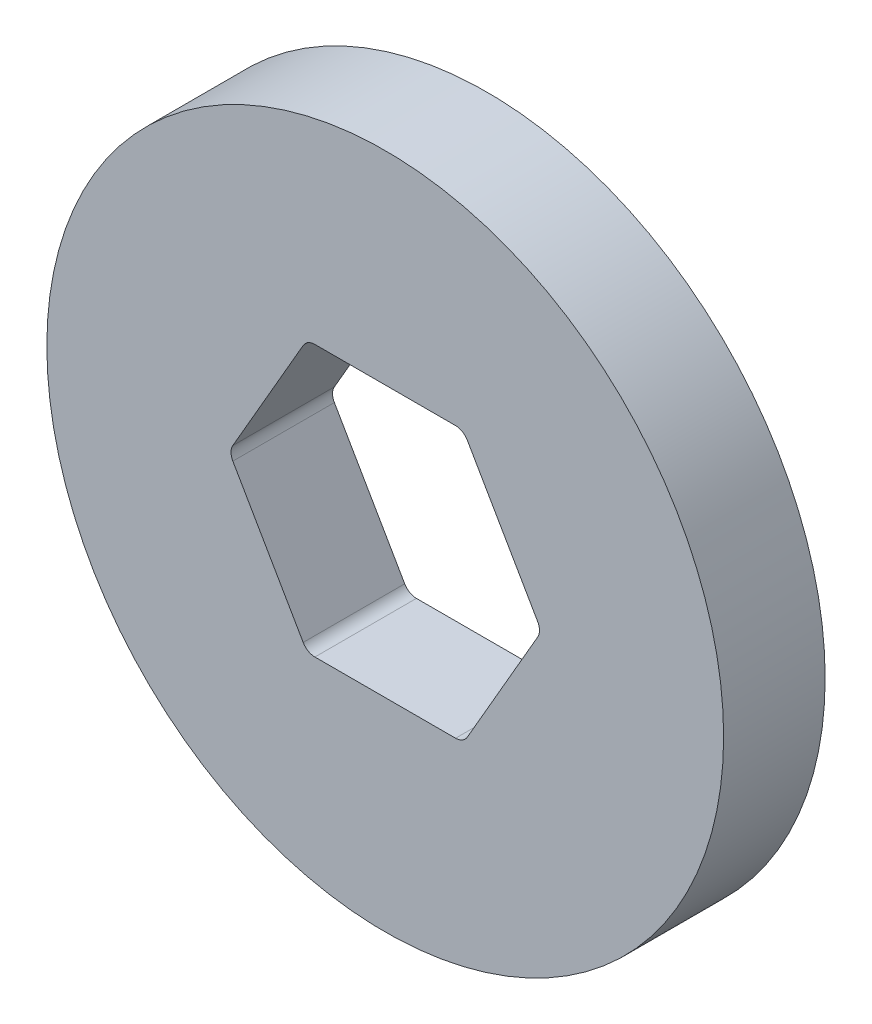
ISO-10303-21;
HEADER;
FILE_DESCRIPTION(('STEP AP214'),'2;1');
FILE_NAME('part.step','',(''),(''),'','','');
FILE_SCHEMA(('AUTOMOTIVE_DESIGN { 1 0 10303 214 1 1 1 1 }'));
ENDSEC;
DATA;
#1=APPLICATION_CONTEXT('core data for automotive mechanical design processes');
#2=APPLICATION_PROTOCOL_DEFINITION('international standard','automotive_design',2000,#1);
#3=PRODUCT_CONTEXT('',#1,'mechanical');
#4=PRODUCT('Part','Part','',(#3));
#5=PRODUCT_RELATED_PRODUCT_CATEGORY('part','',(#4));
#6=PRODUCT_DEFINITION_FORMATION('','',#4);
#7=PRODUCT_DEFINITION_CONTEXT('part definition',#1,'design');
#8=PRODUCT_DEFINITION('design','',#6,#7);
#9=PRODUCT_DEFINITION_SHAPE('','',#8);
#10=(LENGTH_UNIT() NAMED_UNIT(*) SI_UNIT(.MILLI.,.METRE.));
#11=(NAMED_UNIT(*) PLANE_ANGLE_UNIT() SI_UNIT($,.RADIAN.));
#12=(NAMED_UNIT(*) SI_UNIT($,.STERADIAN.) SOLID_ANGLE_UNIT());
#13=UNCERTAINTY_MEASURE_WITH_UNIT(LENGTH_MEASURE(1.E-05),#10,'distance_accuracy_value','');
#14=(GEOMETRIC_REPRESENTATION_CONTEXT(3) GLOBAL_UNCERTAINTY_ASSIGNED_CONTEXT((#13)) GLOBAL_UNIT_ASSIGNED_CONTEXT((#10,
#11,#12)) REPRESENTATION_CONTEXT('',''));
#15=CARTESIAN_POINT('',(0.,0.,0.));
#16=DIRECTION('',(0.,0.,1.));
#17=DIRECTION('',(1.,0.,0.));
#18=AXIS2_PLACEMENT_3D('',#15,#16,#17);
#19=CARTESIAN_POINT('',(0.,0.,15.));
#20=DIRECTION('',(0.,0.,1.));
#21=DIRECTION('',(1.,0.,0.));
#22=AXIS2_PLACEMENT_3D('',#19,#20,#21);
#23=PLANE('',#22);
#24=CARTESIAN_POINT('',(0.,0.,15.));
#25=DIRECTION('',(0.,0.,1.));
#26=DIRECTION('',(1.,0.,0.));
#27=AXIS2_PLACEMENT_3D('',#24,#25,#26);
#28=CIRCLE('',#27,50.);
#29=CARTESIAN_POINT('',(50.,0.,15.));
#30=VERTEX_POINT('',#29);
#31=EDGE_CURVE('E145',#30,#30,#28,.T.);
#32=ORIENTED_EDGE('',*,*,#31,.T.);
#33=EDGE_LOOP('',(#32));
#34=FACE_BOUND('',#33,.T.);
#35=DIRECTION('',(-0.5,0.866025403784438,0.));
#36=VECTOR('',#35,1.);
#37=CARTESIAN_POINT('',(23.094010767585,0.,15.));
#38=LINE('',#37,#36);
#39=CARTESIAN_POINT('',(22.5166604983954,1.,15.));
#40=VERTEX_POINT('',#39);
#41=CARTESIAN_POINT('',(12.1243556529821,19.,15.));
#42=VERTEX_POINT('',#41);
#43=EDGE_CURVE('E208',#40,#42,#38,.T.);
#44=ORIENTED_EDGE('',*,*,#43,.F.);
#45=CARTESIAN_POINT('',(20.7846096908265,0.,15.));
#46=DIRECTION('',(0.,0.,1.));
#47=DIRECTION('',(1.,0.,0.));
#48=AXIS2_PLACEMENT_3D('',#45,#46,#47);
#49=CIRCLE('',#48,2.);
#50=CARTESIAN_POINT('',(22.5166604983954,-1.,15.));
#51=VERTEX_POINT('',#50);
#52=EDGE_CURVE('E186',#40,#51,#49,.F.);
#53=ORIENTED_EDGE('',*,*,#52,.T.);
#54=DIRECTION('',(0.5,0.866025403784439,0.));
#55=VECTOR('',#54,1.);
#56=CARTESIAN_POINT('',(11.5470053837925,-20.,15.));
#57=LINE('',#56,#55);
#58=CARTESIAN_POINT('',(12.1243556529821,-19.,15.));
#59=VERTEX_POINT('',#58);
#60=EDGE_CURVE('E213',#59,#51,#57,.T.);
#61=ORIENTED_EDGE('',*,*,#60,.F.);
#62=CARTESIAN_POINT('',(10.3923048454133,-18.,15.));
#63=DIRECTION('',(0.,0.,1.));
#64=DIRECTION('',(1.,0.,0.));
#65=AXIS2_PLACEMENT_3D('',#62,#63,#64);
#66=CIRCLE('',#65,2.);
#67=CARTESIAN_POINT('',(10.3923048454133,-20.,15.));
#68=VERTEX_POINT('',#67);
#69=EDGE_CURVE('E182',#59,#68,#66,.F.);
#70=ORIENTED_EDGE('',*,*,#69,.T.);
#71=DIRECTION('',(1.,0.,0.));
#72=VECTOR('',#71,1.);
#73=CARTESIAN_POINT('',(-11.5470053837925,-20.,15.));
#74=LINE('',#73,#72);
#75=CARTESIAN_POINT('',(-10.3923048454133,-20.,15.));
#76=VERTEX_POINT('',#75);
#77=EDGE_CURVE('E218',#76,#68,#74,.T.);
#78=ORIENTED_EDGE('',*,*,#77,.F.);
#79=CARTESIAN_POINT('',(-10.3923048454133,-18.,15.));
#80=DIRECTION('',(0.,0.,1.));
#81=DIRECTION('',(1.,0.,0.));
#82=AXIS2_PLACEMENT_3D('',#79,#80,#81);
#83=CIRCLE('',#82,2.);
#84=CARTESIAN_POINT('',(-12.1243556529822,-19.,15.));
#85=VERTEX_POINT('',#84);
#86=EDGE_CURVE('E178',#76,#85,#83,.F.);
#87=ORIENTED_EDGE('',*,*,#86,.T.);
#88=DIRECTION('',(0.5,-0.866025403784438,0.));
#89=VECTOR('',#88,1.);
#90=CARTESIAN_POINT('',(-23.0940107675851,0.,15.));
#91=LINE('',#90,#89);
#92=CARTESIAN_POINT('',(-22.5166604983954,-1.,15.));
#93=VERTEX_POINT('',#92);
#94=EDGE_CURVE('E210',#93,#85,#91,.T.);
#95=ORIENTED_EDGE('',*,*,#94,.F.);
#96=CARTESIAN_POINT('',(-20.7846096908265,0.,15.));
#97=DIRECTION('',(0.,0.,1.));
#98=DIRECTION('',(1.,0.,0.));
#99=AXIS2_PLACEMENT_3D('',#96,#97,#98);
#100=CIRCLE('',#99,2.);
#101=CARTESIAN_POINT('',(-22.5166604983954,1.,15.));
#102=VERTEX_POINT('',#101);
#103=EDGE_CURVE('E48',#93,#102,#100,.F.);
#104=ORIENTED_EDGE('',*,*,#103,.T.);
#105=DIRECTION('',(-0.5,-0.866025403784439,0.));
#106=VECTOR('',#105,1.);
#107=CARTESIAN_POINT('',(-11.5470053837925,20.,15.));
#108=LINE('',#107,#106);
#109=CARTESIAN_POINT('',(-12.1243556529822,19.,15.));
#110=VERTEX_POINT('',#109);
#111=EDGE_CURVE('E204',#110,#102,#108,.T.);
#112=ORIENTED_EDGE('',*,*,#111,.F.);
#113=CARTESIAN_POINT('',(-10.3923048454133,18.,15.));
#114=DIRECTION('',(0.,0.,1.));
#115=DIRECTION('',(1.,0.,0.));
#116=AXIS2_PLACEMENT_3D('',#113,#114,#115);
#117=CIRCLE('',#116,2.);
#118=CARTESIAN_POINT('',(-10.3923048454133,20.,15.));
#119=VERTEX_POINT('',#118);
#120=EDGE_CURVE('E11',#110,#119,#117,.F.);
#121=ORIENTED_EDGE('',*,*,#120,.T.);
#122=DIRECTION('',(-1.,0.,0.));
#123=VECTOR('',#122,1.);
#124=CARTESIAN_POINT('',(11.5470053837925,20.,15.));
#125=LINE('',#124,#123);
#126=CARTESIAN_POINT('',(10.3923048454132,20.,15.));
#127=VERTEX_POINT('',#126);
#128=EDGE_CURVE('E202',#127,#119,#125,.T.);
#129=ORIENTED_EDGE('',*,*,#128,.F.);
#130=CARTESIAN_POINT('',(10.3923048454132,18.,15.));
#131=DIRECTION('',(0.,0.,1.));
#132=DIRECTION('',(1.,0.,0.));
#133=AXIS2_PLACEMENT_3D('',#130,#131,#132);
#134=CIRCLE('',#133,2.);
#135=EDGE_CURVE('E133',#127,#42,#134,.F.);
#136=ORIENTED_EDGE('',*,*,#135,.T.);
#137=EDGE_LOOP('',(#44,#53,#61,#70,#78,#87,#95,#104,#112,#121,#129,#136));
#138=FACE_BOUND('',#137,.T.);
#139=ADVANCED_FACE('F33',(#34,#138),#23,.T.);
#140=CARTESIAN_POINT('',(0.,0.,0.));
#141=DIRECTION('',(0.,0.,1.));
#142=DIRECTION('',(1.,0.,0.));
#143=AXIS2_PLACEMENT_3D('',#140,#141,#142);
#144=PLANE('',#143);
#145=CARTESIAN_POINT('',(0.,0.,0.));
#146=DIRECTION('',(0.,0.,1.));
#147=DIRECTION('',(1.,0.,0.));
#148=AXIS2_PLACEMENT_3D('',#145,#146,#147);
#149=CIRCLE('',#148,50.);
#150=CARTESIAN_POINT('',(50.,0.,0.));
#151=VERTEX_POINT('',#150);
#152=EDGE_CURVE('E150',#151,#151,#149,.T.);
#153=ORIENTED_EDGE('',*,*,#152,.F.);
#154=EDGE_LOOP('',(#153));
#155=FACE_BOUND('',#154,.T.);
#156=DIRECTION('',(1.,0.,0.));
#157=VECTOR('',#156,1.);
#158=CARTESIAN_POINT('',(-11.5470053837925,-20.,0.));
#159=LINE('',#158,#157);
#160=CARTESIAN_POINT('',(-10.3923048454133,-20.,0.));
#161=VERTEX_POINT('',#160);
#162=CARTESIAN_POINT('',(10.3923048454133,-20.,0.));
#163=VERTEX_POINT('',#162);
#164=EDGE_CURVE('E142',#161,#163,#159,.T.);
#165=ORIENTED_EDGE('',*,*,#164,.T.);
#166=CARTESIAN_POINT('',(10.3923048454133,-18.,0.));
#167=DIRECTION('',(0.,0.,1.));
#168=DIRECTION('',(1.,0.,0.));
#169=AXIS2_PLACEMENT_3D('',#166,#167,#168);
#170=CIRCLE('',#169,2.);
#171=CARTESIAN_POINT('',(12.1243556529821,-19.,0.));
#172=VERTEX_POINT('',#171);
#173=EDGE_CURVE('E180',#163,#172,#170,.T.);
#174=ORIENTED_EDGE('',*,*,#173,.T.);
#175=DIRECTION('',(0.5,0.866025403784439,0.));
#176=VECTOR('',#175,1.);
#177=CARTESIAN_POINT('',(11.5470053837925,-20.,0.));
#178=LINE('',#177,#176);
#179=CARTESIAN_POINT('',(22.5166604983954,-1.,0.));
#180=VERTEX_POINT('',#179);
#181=EDGE_CURVE('E221',#172,#180,#178,.T.);
#182=ORIENTED_EDGE('',*,*,#181,.T.);
#183=CARTESIAN_POINT('',(20.7846096908265,0.,0.));
#184=DIRECTION('',(0.,0.,1.));
#185=DIRECTION('',(1.,0.,0.));
#186=AXIS2_PLACEMENT_3D('',#183,#184,#185);
#187=CIRCLE('',#186,2.);
#188=CARTESIAN_POINT('',(22.5166604983954,1.,0.));
#189=VERTEX_POINT('',#188);
#190=EDGE_CURVE('E184',#180,#189,#187,.T.);
#191=ORIENTED_EDGE('',*,*,#190,.T.);
#192=DIRECTION('',(-0.5,0.866025403784438,0.));
#193=VECTOR('',#192,1.);
#194=CARTESIAN_POINT('',(23.094010767585,0.,0.));
#195=LINE('',#194,#193);
#196=CARTESIAN_POINT('',(12.1243556529821,19.,0.));
#197=VERTEX_POINT('',#196);
#198=EDGE_CURVE('E224',#189,#197,#195,.T.);
#199=ORIENTED_EDGE('',*,*,#198,.T.);
#200=CARTESIAN_POINT('',(10.3923048454132,18.,0.));
#201=DIRECTION('',(0.,0.,1.));
#202=DIRECTION('',(1.,0.,0.));
#203=AXIS2_PLACEMENT_3D('',#200,#201,#202);
#204=CIRCLE('',#203,2.);
#205=CARTESIAN_POINT('',(10.3923048454132,20.,0.));
#206=VERTEX_POINT('',#205);
#207=EDGE_CURVE('E188',#197,#206,#204,.T.);
#208=ORIENTED_EDGE('',*,*,#207,.T.);
#209=DIRECTION('',(-1.,0.,0.));
#210=VECTOR('',#209,1.);
#211=CARTESIAN_POINT('',(11.5470053837925,20.,0.));
#212=LINE('',#211,#210);
#213=CARTESIAN_POINT('',(-10.3923048454133,20.,0.));
#214=VERTEX_POINT('',#213);
#215=EDGE_CURVE('E193',#206,#214,#212,.T.);
#216=ORIENTED_EDGE('',*,*,#215,.T.);
#217=CARTESIAN_POINT('',(-10.3923048454133,18.,0.));
#218=DIRECTION('',(0.,0.,1.));
#219=DIRECTION('',(1.,0.,0.));
#220=AXIS2_PLACEMENT_3D('',#217,#218,#219);
#221=CIRCLE('',#220,2.);
#222=CARTESIAN_POINT('',(-12.1243556529822,19.,0.));
#223=VERTEX_POINT('',#222);
#224=EDGE_CURVE('E41',#214,#223,#221,.T.);
#225=ORIENTED_EDGE('',*,*,#224,.T.);
#226=DIRECTION('',(-0.5,-0.866025403784439,0.));
#227=VECTOR('',#226,1.);
#228=CARTESIAN_POINT('',(-11.5470053837925,20.,0.));
#229=LINE('',#228,#227);
#230=CARTESIAN_POINT('',(-22.5166604983954,1.,0.));
#231=VERTEX_POINT('',#230);
#232=EDGE_CURVE('E128',#223,#231,#229,.T.);
#233=ORIENTED_EDGE('',*,*,#232,.T.);
#234=CARTESIAN_POINT('',(-20.7846096908265,0.,0.));
#235=DIRECTION('',(0.,0.,1.));
#236=DIRECTION('',(1.,0.,0.));
#237=AXIS2_PLACEMENT_3D('',#234,#235,#236);
#238=CIRCLE('',#237,2.);
#239=CARTESIAN_POINT('',(-22.5166604983954,-1.,0.));
#240=VERTEX_POINT('',#239);
#241=EDGE_CURVE('E123',#231,#240,#238,.T.);
#242=ORIENTED_EDGE('',*,*,#241,.T.);
#243=DIRECTION('',(0.5,-0.866025403784438,0.));
#244=VECTOR('',#243,1.);
#245=CARTESIAN_POINT('',(-23.0940107675851,0.,0.));
#246=LINE('',#245,#244);
#247=CARTESIAN_POINT('',(-12.1243556529822,-19.,0.));
#248=VERTEX_POINT('',#247);
#249=EDGE_CURVE('E127',#240,#248,#246,.T.);
#250=ORIENTED_EDGE('',*,*,#249,.T.);
#251=CARTESIAN_POINT('',(-10.3923048454133,-18.,0.));
#252=DIRECTION('',(0.,0.,1.));
#253=DIRECTION('',(1.,0.,0.));
#254=AXIS2_PLACEMENT_3D('',#251,#252,#253);
#255=CIRCLE('',#254,2.);
#256=EDGE_CURVE('E176',#248,#161,#255,.T.);
#257=ORIENTED_EDGE('',*,*,#256,.T.);
#258=EDGE_LOOP('',(#165,#174,#182,#191,#199,#208,#216,#225,#233,#242,#250,#257));
#259=FACE_BOUND('',#258,.T.);
#260=ADVANCED_FACE('F126',(#155,#259),#144,.F.);
#261=CARTESIAN_POINT('',(0.,0.,15.));
#262=DIRECTION('',(0.,0.,-1.));
#263=DIRECTION('',(-1.,0.,0.));
#264=AXIS2_PLACEMENT_3D('',#261,#262,#263);
#265=CYLINDRICAL_SURFACE('',#264,50.);
#266=ORIENTED_EDGE('',*,*,#31,.F.);
#267=EDGE_LOOP('',(#266));
#268=FACE_BOUND('',#267,.T.);
#269=ORIENTED_EDGE('',*,*,#152,.T.);
#270=EDGE_LOOP('',(#269));
#271=FACE_BOUND('',#270,.T.);
#272=ADVANCED_FACE('F262',(#268,#271),#265,.T.);
#273=CARTESIAN_POINT('',(11.5470053837925,-20.,15.));
#274=DIRECTION('',(-0.866025403784439,0.5,0.));
#275=DIRECTION('',(-0.5,-0.866025403784439,0.));
#276=AXIS2_PLACEMENT_3D('',#273,#274,#275);
#277=PLANE('',#276);
#278=ORIENTED_EDGE('',*,*,#181,.F.);
#279=DIRECTION('',(0.,0.,-1.));
#280=VECTOR('',#279,1.);
#281=CARTESIAN_POINT('',(12.1243556529821,-19.,15.));
#282=LINE('',#281,#280);
#283=EDGE_CURVE('E161',#172,#59,#282,.F.);
#284=ORIENTED_EDGE('',*,*,#283,.T.);
#285=ORIENTED_EDGE('',*,*,#60,.T.);
#286=DIRECTION('',(0.,0.,-1.));
#287=VECTOR('',#286,1.);
#288=CARTESIAN_POINT('',(22.5166604983954,-1.,0.));
#289=LINE('',#288,#287);
#290=EDGE_CURVE('E158',#51,#180,#289,.T.);
#291=ORIENTED_EDGE('',*,*,#290,.T.);
#292=EDGE_LOOP('',(#278,#284,#285,#291));
#293=FACE_BOUND('',#292,.T.);
#294=ADVANCED_FACE('F234',(#293),#277,.T.);
#295=CARTESIAN_POINT('',(23.094010767585,0.,15.));
#296=DIRECTION('',(-0.866025403784439,-0.5,0.));
#297=DIRECTION('',(0.5,-0.866025403784439,0.));
#298=AXIS2_PLACEMENT_3D('',#295,#296,#297);
#299=PLANE('',#298);
#300=ORIENTED_EDGE('',*,*,#198,.F.);
#301=DIRECTION('',(0.,0.,-1.));
#302=VECTOR('',#301,1.);
#303=CARTESIAN_POINT('',(22.5166604983954,1.,15.));
#304=LINE('',#303,#302);
#305=EDGE_CURVE('E166',#189,#40,#304,.F.);
#306=ORIENTED_EDGE('',*,*,#305,.T.);
#307=ORIENTED_EDGE('',*,*,#43,.T.);
#308=DIRECTION('',(0.,0.,-1.));
#309=VECTOR('',#308,1.);
#310=CARTESIAN_POINT('',(12.1243556529821,19.,0.));
#311=LINE('',#310,#309);
#312=EDGE_CURVE('E163',#42,#197,#311,.T.);
#313=ORIENTED_EDGE('',*,*,#312,.T.);
#314=EDGE_LOOP('',(#300,#306,#307,#313));
#315=FACE_BOUND('',#314,.T.);
#316=ADVANCED_FACE('F243',(#315),#299,.T.);
#317=CARTESIAN_POINT('',(11.5470053837925,20.,15.));
#318=DIRECTION('',(0.,-1.,0.));
#319=DIRECTION('',(0.,0.,-1.));
#320=AXIS2_PLACEMENT_3D('',#317,#318,#319);
#321=PLANE('',#320);
#322=ORIENTED_EDGE('',*,*,#215,.F.);
#323=DIRECTION('',(0.,0.,-1.));
#324=VECTOR('',#323,1.);
#325=CARTESIAN_POINT('',(10.3923048454132,20.,15.));
#326=LINE('',#325,#324);
#327=EDGE_CURVE('E171',#206,#127,#326,.F.);
#328=ORIENTED_EDGE('',*,*,#327,.T.);
#329=ORIENTED_EDGE('',*,*,#128,.T.);
#330=DIRECTION('',(0.,0.,-1.));
#331=VECTOR('',#330,1.);
#332=CARTESIAN_POINT('',(-10.3923048454133,20.,0.));
#333=LINE('',#332,#331);
#334=EDGE_CURVE('E168',#119,#214,#333,.T.);
#335=ORIENTED_EDGE('',*,*,#334,.T.);
#336=EDGE_LOOP('',(#322,#328,#329,#335));
#337=FACE_BOUND('',#336,.T.);
#338=ADVANCED_FACE('F206',(#337),#321,.T.);
#339=CARTESIAN_POINT('',(-11.5470053837925,20.,15.));
#340=DIRECTION('',(0.866025403784439,-0.5,0.));
#341=DIRECTION('',(0.5,0.866025403784439,0.));
#342=AXIS2_PLACEMENT_3D('',#339,#340,#341);
#343=PLANE('',#342);
#344=ORIENTED_EDGE('',*,*,#111,.T.);
#345=DIRECTION('',(0.,0.,-1.));
#346=VECTOR('',#345,1.);
#347=CARTESIAN_POINT('',(-22.5166604983954,1.,0.));
#348=LINE('',#347,#346);
#349=EDGE_CURVE('E174',#102,#231,#348,.T.);
#350=ORIENTED_EDGE('',*,*,#349,.T.);
#351=ORIENTED_EDGE('',*,*,#232,.F.);
#352=DIRECTION('',(0.,0.,-1.));
#353=VECTOR('',#352,1.);
#354=CARTESIAN_POINT('',(-12.1243556529822,19.,15.));
#355=LINE('',#354,#353);
#356=EDGE_CURVE('E55',#223,#110,#355,.F.);
#357=ORIENTED_EDGE('',*,*,#356,.T.);
#358=EDGE_LOOP('',(#344,#350,#351,#357));
#359=FACE_BOUND('',#358,.T.);
#360=ADVANCED_FACE('F196',(#359),#343,.T.);
#361=CARTESIAN_POINT('',(-23.0940107675851,0.,15.));
#362=DIRECTION('',(0.866025403784439,0.5,0.));
#363=DIRECTION('',(-0.5,0.866025403784439,0.));
#364=AXIS2_PLACEMENT_3D('',#361,#362,#363);
#365=PLANE('',#364);
#366=ORIENTED_EDGE('',*,*,#94,.T.);
#367=DIRECTION('',(0.,0.,-1.));
#368=VECTOR('',#367,1.);
#369=CARTESIAN_POINT('',(-12.1243556529821,-19.,0.));
#370=LINE('',#369,#368);
#371=EDGE_CURVE('E141',#85,#248,#370,.T.);
#372=ORIENTED_EDGE('',*,*,#371,.T.);
#373=ORIENTED_EDGE('',*,*,#249,.F.);
#374=DIRECTION('',(0.,0.,-1.));
#375=VECTOR('',#374,1.);
#376=CARTESIAN_POINT('',(-22.5166604983954,-1.,15.));
#377=LINE('',#376,#375);
#378=EDGE_CURVE('E139',#240,#93,#377,.F.);
#379=ORIENTED_EDGE('',*,*,#378,.T.);
#380=EDGE_LOOP('',(#366,#372,#373,#379));
#381=FACE_BOUND('',#380,.T.);
#382=ADVANCED_FACE('F138',(#381),#365,.T.);
#383=CARTESIAN_POINT('',(-11.5470053837925,-20.,15.));
#384=DIRECTION('',(0.,1.,0.));
#385=DIRECTION('',(-1.,0.,0.));
#386=AXIS2_PLACEMENT_3D('',#383,#384,#385);
#387=PLANE('',#386);
#388=ORIENTED_EDGE('',*,*,#164,.F.);
#389=DIRECTION('',(0.,0.,-1.));
#390=VECTOR('',#389,1.);
#391=CARTESIAN_POINT('',(-10.3923048454133,-20.,15.));
#392=LINE('',#391,#390);
#393=EDGE_CURVE('E156',#161,#76,#392,.F.);
#394=ORIENTED_EDGE('',*,*,#393,.T.);
#395=ORIENTED_EDGE('',*,*,#77,.T.);
#396=DIRECTION('',(0.,0.,-1.));
#397=VECTOR('',#396,1.);
#398=CARTESIAN_POINT('',(10.3923048454133,-20.,0.));
#399=LINE('',#398,#397);
#400=EDGE_CURVE('E147',#68,#163,#399,.T.);
#401=ORIENTED_EDGE('',*,*,#400,.T.);
#402=EDGE_LOOP('',(#388,#394,#395,#401));
#403=FACE_BOUND('',#402,.T.);
#404=ADVANCED_FACE('F274',(#403),#387,.T.);
#405=CARTESIAN_POINT('',(-10.3923048454133,-18.,15.));
#406=DIRECTION('',(0.,0.,1.));
#407=DIRECTION('',(1.,0.,0.));
#408=AXIS2_PLACEMENT_3D('',#405,#406,#407);
#409=CYLINDRICAL_SURFACE('',#408,2.);
#410=ORIENTED_EDGE('',*,*,#86,.F.);
#411=ORIENTED_EDGE('',*,*,#393,.F.);
#412=ORIENTED_EDGE('',*,*,#256,.F.);
#413=ORIENTED_EDGE('',*,*,#371,.F.);
#414=EDGE_LOOP('',(#410,#411,#412,#413));
#415=FACE_BOUND('',#414,.T.);
#416=ADVANCED_FACE('F271',(#415),#409,.F.);
#417=CARTESIAN_POINT('',(10.3923048454133,-18.,15.));
#418=DIRECTION('',(0.,0.,1.));
#419=DIRECTION('',(1.,0.,0.));
#420=AXIS2_PLACEMENT_3D('',#417,#418,#419);
#421=CYLINDRICAL_SURFACE('',#420,2.);
#422=ORIENTED_EDGE('',*,*,#69,.F.);
#423=ORIENTED_EDGE('',*,*,#283,.F.);
#424=ORIENTED_EDGE('',*,*,#173,.F.);
#425=ORIENTED_EDGE('',*,*,#400,.F.);
#426=EDGE_LOOP('',(#422,#423,#424,#425));
#427=FACE_BOUND('',#426,.T.);
#428=ADVANCED_FACE('F253',(#427),#421,.F.);
#429=CARTESIAN_POINT('',(20.7846096908265,0.,15.));
#430=DIRECTION('',(0.,0.,1.));
#431=DIRECTION('',(1.,0.,0.));
#432=AXIS2_PLACEMENT_3D('',#429,#430,#431);
#433=CYLINDRICAL_SURFACE('',#432,2.);
#434=ORIENTED_EDGE('',*,*,#52,.F.);
#435=ORIENTED_EDGE('',*,*,#305,.F.);
#436=ORIENTED_EDGE('',*,*,#190,.F.);
#437=ORIENTED_EDGE('',*,*,#290,.F.);
#438=EDGE_LOOP('',(#434,#435,#436,#437));
#439=FACE_BOUND('',#438,.T.);
#440=ADVANCED_FACE('F239',(#439),#433,.F.);
#441=CARTESIAN_POINT('',(10.3923048454132,18.,15.));
#442=DIRECTION('',(0.,0.,1.));
#443=DIRECTION('',(1.,0.,0.));
#444=AXIS2_PLACEMENT_3D('',#441,#442,#443);
#445=CYLINDRICAL_SURFACE('',#444,2.);
#446=ORIENTED_EDGE('',*,*,#135,.F.);
#447=ORIENTED_EDGE('',*,*,#327,.F.);
#448=ORIENTED_EDGE('',*,*,#207,.F.);
#449=ORIENTED_EDGE('',*,*,#312,.F.);
#450=EDGE_LOOP('',(#446,#447,#448,#449));
#451=FACE_BOUND('',#450,.T.);
#452=ADVANCED_FACE('F246',(#451),#445,.F.);
#453=CARTESIAN_POINT('',(-20.7846096908265,0.,15.));
#454=DIRECTION('',(0.,0.,1.));
#455=DIRECTION('',(1.,0.,0.));
#456=AXIS2_PLACEMENT_3D('',#453,#454,#455);
#457=CYLINDRICAL_SURFACE('',#456,2.);
#458=ORIENTED_EDGE('',*,*,#103,.F.);
#459=ORIENTED_EDGE('',*,*,#378,.F.);
#460=ORIENTED_EDGE('',*,*,#241,.F.);
#461=ORIENTED_EDGE('',*,*,#349,.F.);
#462=EDGE_LOOP('',(#458,#459,#460,#461));
#463=FACE_BOUND('',#462,.T.);
#464=ADVANCED_FACE('F144',(#463),#457,.F.);
#465=CARTESIAN_POINT('',(-10.3923048454133,18.,15.));
#466=DIRECTION('',(0.,0.,1.));
#467=DIRECTION('',(1.,0.,0.));
#468=AXIS2_PLACEMENT_3D('',#465,#466,#467);
#469=CYLINDRICAL_SURFACE('',#468,2.);
#470=ORIENTED_EDGE('',*,*,#120,.F.);
#471=ORIENTED_EDGE('',*,*,#356,.F.);
#472=ORIENTED_EDGE('',*,*,#224,.F.);
#473=ORIENTED_EDGE('',*,*,#334,.F.);
#474=EDGE_LOOP('',(#470,#471,#472,#473));
#475=FACE_BOUND('',#474,.T.);
#476=ADVANCED_FACE('F35',(#475),#469,.F.);
#477=CLOSED_SHELL('',(#139,#260,#272,#294,#316,#338,#360,#382,#404,#416,#428,#440,#452,#464,#476));
#478=MANIFOLD_SOLID_BREP('B2',#477);
#479=ADVANCED_BREP_SHAPE_REPRESENTATION('',(#18,#478),#14);
#480=SHAPE_DEFINITION_REPRESENTATION(#9,#479);
ENDSEC;
END-ISO-10303-21;
